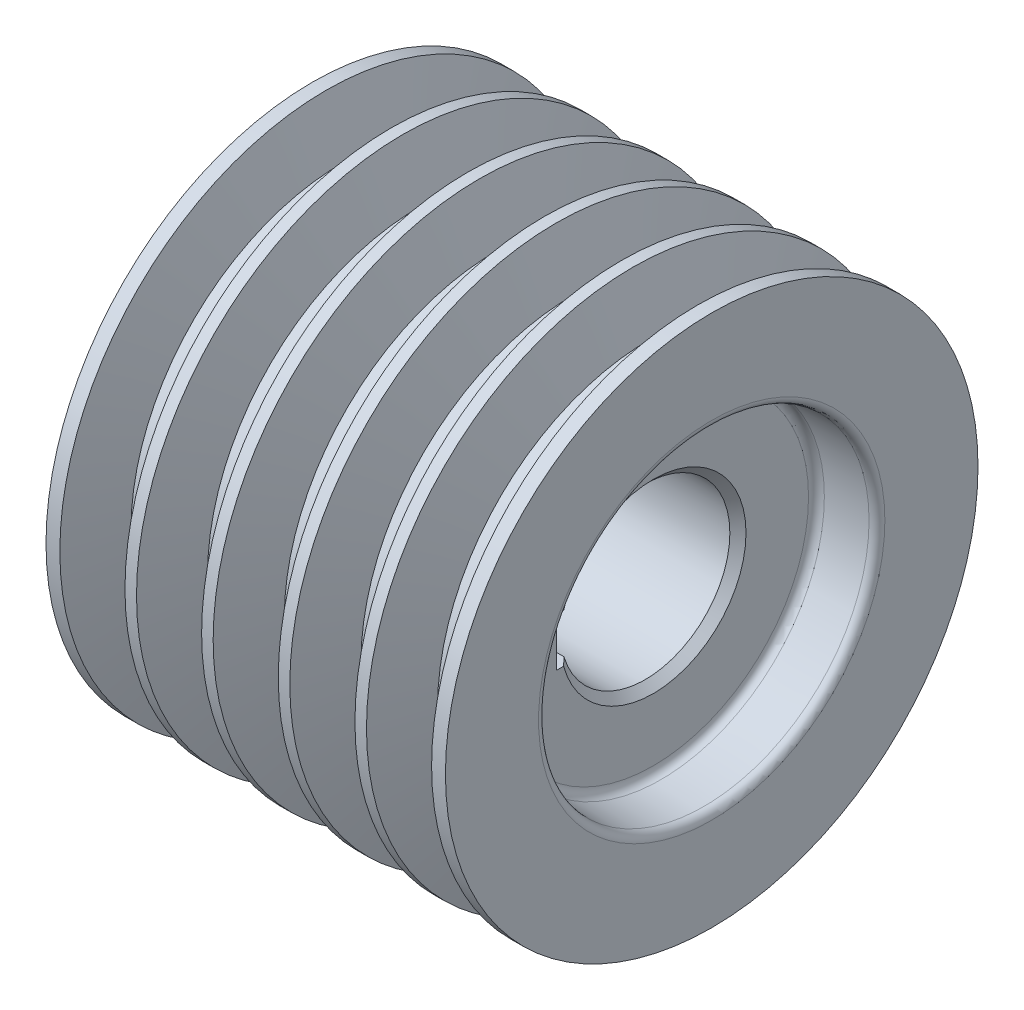
ISO-10303-21;
HEADER;
FILE_DESCRIPTION(('STEP AP214'),'2;1');
FILE_NAME('part.step','',(''),(''),'','','');
FILE_SCHEMA(('AUTOMOTIVE_DESIGN { 1 0 10303 214 1 1 1 1 }'));
ENDSEC;
DATA;
#1=APPLICATION_CONTEXT('core data for automotive mechanical design processes');
#2=APPLICATION_PROTOCOL_DEFINITION('international standard','automotive_design',2000,#1);
#3=PRODUCT_CONTEXT('',#1,'mechanical');
#4=PRODUCT('Part','Part','',(#3));
#5=PRODUCT_RELATED_PRODUCT_CATEGORY('part','',(#4));
#6=PRODUCT_DEFINITION_FORMATION('','',#4);
#7=PRODUCT_DEFINITION_CONTEXT('part definition',#1,'design');
#8=PRODUCT_DEFINITION('design','',#6,#7);
#9=PRODUCT_DEFINITION_SHAPE('','',#8);
#10=(LENGTH_UNIT() NAMED_UNIT(*) SI_UNIT(.MILLI.,.METRE.));
#11=(NAMED_UNIT(*) PLANE_ANGLE_UNIT() SI_UNIT($,.RADIAN.));
#12=(NAMED_UNIT(*) SI_UNIT($,.STERADIAN.) SOLID_ANGLE_UNIT());
#13=UNCERTAINTY_MEASURE_WITH_UNIT(LENGTH_MEASURE(1.E-05),#10,'distance_accuracy_value','');
#14=(GEOMETRIC_REPRESENTATION_CONTEXT(3) GLOBAL_UNCERTAINTY_ASSIGNED_CONTEXT((#13)) GLOBAL_UNIT_ASSIGNED_CONTEXT((#10,
#11,#12)) REPRESENTATION_CONTEXT('',''));
#15=CARTESIAN_POINT('',(0.,0.,0.));
#16=DIRECTION('',(0.,0.,1.));
#17=DIRECTION('',(1.,0.,0.));
#18=AXIS2_PLACEMENT_3D('',#15,#16,#17);
#19=CARTESIAN_POINT('',(65.4522263599045,-20.8911772421215,0.));
#20=DIRECTION('',(1.,0.,0.));
#21=DIRECTION('',(0.,0.,1.));
#22=AXIS2_PLACEMENT_3D('',#19,#20,#21);
#23=PLANE('',#22);
#24=CARTESIAN_POINT('',(65.4522263599045,-20.8911772421215,0.));
#25=DIRECTION('',(1.,0.,0.));
#26=DIRECTION('',(0.,0.,-1.));
#27=AXIS2_PLACEMENT_3D('',#24,#25,#26);
#28=CIRCLE('',#27,38.4985347953821);
#29=CARTESIAN_POINT('',(65.4522263599045,-20.8911772421215,-38.4985347953821));
#30=VERTEX_POINT('',#29);
#31=EDGE_CURVE('E253',#30,#30,#28,.T.);
#32=ORIENTED_EDGE('',*,*,#31,.T.);
#33=EDGE_LOOP('',(#32));
#34=FACE_BOUND('',#33,.T.);
#35=CARTESIAN_POINT('',(65.4522263599045,-20.8911772421215,0.));
#36=DIRECTION('',(1.,0.,0.));
#37=DIRECTION('',(0.,0.,-1.));
#38=AXIS2_PLACEMENT_3D('',#35,#36,#37);
#39=CIRCLE('',#38,23.0000000000001);
#40=CARTESIAN_POINT('',(65.4522263599045,-14.8911772421215,22.2036033111746));
#41=VERTEX_POINT('',#40);
#42=CARTESIAN_POINT('',(65.4522263599045,-26.8911772421215,22.2036033111746));
#43=VERTEX_POINT('',#42);
#44=EDGE_CURVE('E264',#41,#43,#39,.F.);
#45=ORIENTED_EDGE('',*,*,#44,.T.);
#46=DIRECTION('',(0.,0.,1.));
#47=VECTOR('',#46,1.);
#48=CARTESIAN_POINT('',(65.4522263599045,-26.8911772421215,-84.8381979060779));
#49=LINE('',#48,#47);
#50=CARTESIAN_POINT('',(65.4522263599045,-26.8911772421215,24.));
#51=VERTEX_POINT('',#50);
#52=EDGE_CURVE('E109',#43,#51,#49,.T.);
#53=ORIENTED_EDGE('',*,*,#52,.T.);
#54=DIRECTION('',(0.,-1.,0.));
#55=VECTOR('',#54,1.);
#56=CARTESIAN_POINT('',(65.4522263599045,-20.8911772421215,24.));
#57=LINE('',#56,#55);
#58=CARTESIAN_POINT('',(65.4522263599045,-14.8911772421215,24.));
#59=VERTEX_POINT('',#58);
#60=EDGE_CURVE('E105',#59,#51,#57,.T.);
#61=ORIENTED_EDGE('',*,*,#60,.F.);
#62=DIRECTION('',(0.,0.,1.));
#63=VECTOR('',#62,1.);
#64=CARTESIAN_POINT('',(65.4522263599045,-14.8911772421215,-84.8381979060779));
#65=LINE('',#64,#63);
#66=EDGE_CURVE('E112',#41,#59,#65,.T.);
#67=ORIENTED_EDGE('',*,*,#66,.F.);
#68=EDGE_LOOP('',(#45,#53,#61,#67));
#69=FACE_BOUND('',#68,.T.);
#70=ADVANCED_FACE('F47',(#34,#69),#23,.T.);
#71=CARTESIAN_POINT('',(-4.54777364009548,-20.8911772421215,0.));
#72=DIRECTION('',(-1.,0.,0.));
#73=DIRECTION('',(0.,0.,1.));
#74=AXIS2_PLACEMENT_3D('',#71,#72,#73);
#75=PLANE('',#74);
#76=CARTESIAN_POINT('',(-4.54777364009548,-20.8911772421215,0.));
#77=DIRECTION('',(-1.,0.,0.));
#78=DIRECTION('',(0.,0.,1.));
#79=AXIS2_PLACEMENT_3D('',#76,#77,#78);
#80=CIRCLE('',#79,38.4985347953821);
#81=CARTESIAN_POINT('',(-4.54777364009548,-20.8911772421215,38.4985347953821));
#82=VERTEX_POINT('',#81);
#83=EDGE_CURVE('E235',#82,#82,#80,.T.);
#84=ORIENTED_EDGE('',*,*,#83,.T.);
#85=EDGE_LOOP('',(#84));
#86=FACE_BOUND('',#85,.T.);
#87=DIRECTION('',(0.,1.,0.));
#88=VECTOR('',#87,1.);
#89=CARTESIAN_POINT('',(-4.54777364009548,-20.8911772421215,24.));
#90=LINE('',#89,#88);
#91=CARTESIAN_POINT('',(-4.54777364009548,-26.8911772421215,24.));
#92=VERTEX_POINT('',#91);
#93=CARTESIAN_POINT('',(-4.54777364009548,-14.8911772421215,24.));
#94=VERTEX_POINT('',#93);
#95=EDGE_CURVE('E13',#92,#94,#90,.T.);
#96=ORIENTED_EDGE('',*,*,#95,.F.);
#97=DIRECTION('',(0.,0.,-1.));
#98=VECTOR('',#97,1.);
#99=CARTESIAN_POINT('',(-4.54777364009548,-26.8911772421215,0.));
#100=LINE('',#99,#98);
#101=CARTESIAN_POINT('',(-4.54777364009548,-26.8911772421215,22.2036033111746));
#102=VERTEX_POINT('',#101);
#103=EDGE_CURVE('E169',#92,#102,#100,.T.);
#104=ORIENTED_EDGE('',*,*,#103,.T.);
#105=CARTESIAN_POINT('',(-4.54777364009548,-20.8911772421215,0.));
#106=DIRECTION('',(-1.,0.,0.));
#107=DIRECTION('',(0.,0.,1.));
#108=AXIS2_PLACEMENT_3D('',#105,#106,#107);
#109=CIRCLE('',#108,23.0000000000001);
#110=CARTESIAN_POINT('',(-4.54777364009548,-14.8911772421215,22.2036033111746));
#111=VERTEX_POINT('',#110);
#112=EDGE_CURVE('E152',#102,#111,#109,.F.);
#113=ORIENTED_EDGE('',*,*,#112,.T.);
#114=DIRECTION('',(0.,0.,-1.));
#115=VECTOR('',#114,1.);
#116=CARTESIAN_POINT('',(-4.54777364009548,-14.8911772421215,0.));
#117=LINE('',#116,#115);
#118=EDGE_CURVE('E63',#94,#111,#117,.T.);
#119=ORIENTED_EDGE('',*,*,#118,.F.);
#120=EDGE_LOOP('',(#96,#104,#113,#119));
#121=FACE_BOUND('',#120,.T.);
#122=ADVANCED_FACE('F269',(#86,#121),#75,.T.);
#123=CARTESIAN_POINT('',(79.9522263599045,-20.8911772421215,0.));
#124=DIRECTION('',(-1.,0.,0.));
#125=DIRECTION('',(0.,0.,1.));
#126=AXIS2_PLACEMENT_3D('',#123,#124,#125);
#127=CYLINDRICAL_SURFACE('',#126,21.);
#128=DIRECTION('',(-1.,0.,0.));
#129=VECTOR('',#128,1.);
#130=CARTESIAN_POINT('',(79.9522263599045,-26.8911772421215,20.1246117974981));
#131=LINE('',#130,#129);
#132=CARTESIAN_POINT('',(63.4522263599045,-26.8911772421215,20.1246117974981));
#133=VERTEX_POINT('',#132);
#134=CARTESIAN_POINT('',(-2.54777364009537,-26.8911772421215,20.1246117974981));
#135=VERTEX_POINT('',#134);
#136=EDGE_CURVE('E133',#133,#135,#131,.T.);
#137=ORIENTED_EDGE('',*,*,#136,.F.);
#138=CARTESIAN_POINT('',(63.4522263599045,-20.8911772421215,0.));
#139=DIRECTION('',(1.,0.,0.));
#140=DIRECTION('',(0.,0.,-1.));
#141=AXIS2_PLACEMENT_3D('',#138,#139,#140);
#142=CIRCLE('',#141,21.);
#143=CARTESIAN_POINT('',(63.4522263599045,-14.8911772421215,20.1246117974981));
#144=VERTEX_POINT('',#143);
#145=EDGE_CURVE('E262',#133,#144,#142,.T.);
#146=ORIENTED_EDGE('',*,*,#145,.T.);
#147=DIRECTION('',(-1.,0.,0.));
#148=VECTOR('',#147,1.);
#149=CARTESIAN_POINT('',(79.9522263599045,-14.8911772421215,20.1246117974981));
#150=LINE('',#149,#148);
#151=CARTESIAN_POINT('',(-2.54777364009537,-14.8911772421215,20.1246117974981));
#152=VERTEX_POINT('',#151);
#153=EDGE_CURVE('E123',#144,#152,#150,.T.);
#154=ORIENTED_EDGE('',*,*,#153,.T.);
#155=CARTESIAN_POINT('',(-2.54777364009537,-20.8911772421215,0.));
#156=DIRECTION('',(-1.,0.,0.));
#157=DIRECTION('',(0.,0.,1.));
#158=AXIS2_PLACEMENT_3D('',#155,#156,#157);
#159=CIRCLE('',#158,21.);
#160=EDGE_CURVE('E259',#152,#135,#159,.T.);
#161=ORIENTED_EDGE('',*,*,#160,.T.);
#162=EDGE_LOOP('',(#137,#146,#154,#161));
#163=FACE_BOUND('',#162,.T.);
#164=ADVANCED_FACE('F143',(#163),#127,.F.);
#165=CARTESIAN_POINT('',(63.4522263599045,-20.8911772421215,0.));
#166=DIRECTION('',(1.,0.,0.));
#167=DIRECTION('',(0.,0.,-1.));
#168=AXIS2_PLACEMENT_3D('',#165,#166,#167);
#169=CONICAL_SURFACE('',#168,21.,0.785398163397455);
#170=ORIENTED_EDGE('',*,*,#145,.F.);
#171=CARTESIAN_POINT('',(54.8035117336276,-26.8911772421215,10.7960293804316));
#172=CARTESIAN_POINT('',(54.9874683818524,-26.8911772421215,11.0064760608039));
#173=CARTESIAN_POINT('',(55.1721324443452,-26.8911772421215,11.2163019613483));
#174=CARTESIAN_POINT('',(55.5426955892584,-26.8911772421215,11.6348571742131));
#175=CARTESIAN_POINT('',(55.7285946601478,-26.8911772421215,11.8435864967395));
#176=CARTESIAN_POINT('',(56.287865444874,-26.8911772421215,12.4683368309857));
#177=CARTESIAN_POINT('',(56.6628249676077,-26.8911772421215,12.8829364421599));
#178=CARTESIAN_POINT('',(57.4159203479209,-26.8911772421215,13.7091553987322));
#179=CARTESIAN_POINT('',(57.7940558684335,-26.8911772421215,14.1207750519698));
#180=CARTESIAN_POINT('',(58.5528411247313,-26.8911772421215,14.9416973461213));
#181=CARTESIAN_POINT('',(58.9334908888128,-26.8911772421215,15.3509999608617));
#182=CARTESIAN_POINT('',(59.6967265109114,-26.8911772421215,16.1676802660682));
#183=CARTESIAN_POINT('',(60.0793120716715,-26.8911772421215,16.5750582345497));
#184=CARTESIAN_POINT('',(60.8460942921171,-26.8911772421215,17.3882911500777));
#185=CARTESIAN_POINT('',(61.2302909453887,-26.8911772421215,17.7941461031753));
#186=CARTESIAN_POINT('',(62.38487308172,-26.8911772421215,19.0098703462348));
#187=CARTESIAN_POINT('',(63.1572251727058,-26.8911772421215,19.8178717460958));
#188=CARTESIAN_POINT('',(64.6575628550957,-26.8911772421215,21.380394176371));
#189=CARTESIAN_POINT('',(65.3853302659242,-26.8911772421215,22.1351250485647));
#190=CARTESIAN_POINT('',(66.8432381463396,-26.8911772421215,23.6422921576677));
#191=CARTESIAN_POINT('',(67.573378618481,-26.8911772421215,24.3947283921053));
#192=CARTESIAN_POINT('',(69.0354517777227,-26.8911772421215,25.8978423410628));
#193=CARTESIAN_POINT('',(69.7673844471831,-26.8911772421215,26.6485200727498));
#194=CARTESIAN_POINT('',(71.2326499096059,-26.8911772421215,28.14850794147));
#195=CARTESIAN_POINT('',(71.9659827030211,-26.8911772421215,28.8978180780607));
#196=CARTESIAN_POINT('',(73.4339285489622,-26.8911772421215,30.395524743977));
#197=CARTESIAN_POINT('',(74.1685418595948,-26.8911772421215,31.1439210202663));
#198=CARTESIAN_POINT('',(75.6386640120986,-26.8911772421215,32.6398337037583));
#199=CARTESIAN_POINT('',(76.374172854188,-26.8911772421215,33.3873501107466));
#200=CARTESIAN_POINT('',(77.8459182926841,-26.8911772421215,34.8816599216298));
#201=CARTESIAN_POINT('',(78.5821548860503,-26.8911772421215,35.6284533285199));
#202=CARTESIAN_POINT('',(80.0552384404733,-26.8911772421215,37.1214369154791));
#203=CARTESIAN_POINT('',(80.7920854011044,-26.8911772421215,37.8676270959683));
#204=CARTESIAN_POINT('',(81.5291778375467,-26.8911772421215,38.6135745144894));
#205=B_SPLINE_CURVE_WITH_KNOTS('',3,(#171,#172,#173,#174,#175,#176,#177,#178,#179,#180,#181,
#182,#183,#184,#185,#186,#187,#188,#189,#190,#191,#192,#193,#194,#195,#196,#197,#198,#199,#200,
#201,#202,#203,#204),.UNSPECIFIED.,.F.,.F.,(4,2,2,2,2,2,2,2,2,2,2,2,2,2,2,2,4),(0.,
0.838536441067098,1.67706506382705,3.35405753845586,5.03087422882484,6.70770982299641,
8.38429530016524,10.0608741089577,13.4141438782229,16.5595120886771,19.7048836860309,
22.8502244480418,25.9955662274287,29.1416395923243,32.2877137234949,35.4337747650234,
38.579833613669),.UNSPECIFIED.);
#206=EDGE_CURVE('E71',#133,#43,#205,.T.);
#207=ORIENTED_EDGE('',*,*,#206,.T.);
#208=ORIENTED_EDGE('',*,*,#44,.F.);
#209=CARTESIAN_POINT('',(54.8035117336276,-14.8911772421215,10.7960293804316));
#210=CARTESIAN_POINT('',(54.9874683818524,-14.8911772421215,11.0064760608039));
#211=CARTESIAN_POINT('',(55.1721324443452,-14.8911772421215,11.2163019613484));
#212=CARTESIAN_POINT('',(55.5426955892584,-14.8911772421215,11.6348571742131));
#213=CARTESIAN_POINT('',(55.7285946601478,-14.8911772421215,11.8435864967395));
#214=CARTESIAN_POINT('',(56.287865444874,-14.8911772421215,12.4683368309857));
#215=CARTESIAN_POINT('',(56.6628249676077,-14.8911772421215,12.8829364421599));
#216=CARTESIAN_POINT('',(57.4159203479209,-14.8911772421215,13.7091553987323));
#217=CARTESIAN_POINT('',(57.7940558684335,-14.8911772421215,14.1207750519698));
#218=CARTESIAN_POINT('',(58.5528411247313,-14.8911772421215,14.9416973461213));
#219=CARTESIAN_POINT('',(58.9334908888128,-14.8911772421215,15.3509999608617));
#220=CARTESIAN_POINT('',(59.6967265109114,-14.8911772421215,16.1676802660682));
#221=CARTESIAN_POINT('',(60.0793120716715,-14.8911772421215,16.5750582345497));
#222=CARTESIAN_POINT('',(60.8460942921171,-14.8911772421215,17.3882911500777));
#223=CARTESIAN_POINT('',(61.2302909453887,-14.8911772421215,17.7941461031753));
#224=CARTESIAN_POINT('',(62.38487308172,-14.8911772421215,19.0098703462348));
#225=CARTESIAN_POINT('',(63.1572251727058,-14.8911772421215,19.8178717460958));
#226=CARTESIAN_POINT('',(64.6575628550957,-14.8911772421215,21.380394176371));
#227=CARTESIAN_POINT('',(65.3853302659242,-14.8911772421215,22.1351250485647));
#228=CARTESIAN_POINT('',(66.8432381463396,-14.8911772421215,23.6422921576677));
#229=CARTESIAN_POINT('',(67.573378618481,-14.8911772421215,24.3947283921053));
#230=CARTESIAN_POINT('',(69.0354517777227,-14.8911772421215,25.8978423410628));
#231=CARTESIAN_POINT('',(69.7673844471831,-14.8911772421215,26.6485200727498));
#232=CARTESIAN_POINT('',(71.2326499096059,-14.8911772421215,28.14850794147));
#233=CARTESIAN_POINT('',(71.9659827030211,-14.8911772421215,28.8978180780606));
#234=CARTESIAN_POINT('',(73.4339285489622,-14.8911772421215,30.395524743977));
#235=CARTESIAN_POINT('',(74.1685418595948,-14.8911772421215,31.1439210202663));
#236=CARTESIAN_POINT('',(75.6386640120986,-14.8911772421215,32.6398337037583));
#237=CARTESIAN_POINT('',(76.374172854188,-14.8911772421215,33.3873501107466));
#238=CARTESIAN_POINT('',(77.8459182926841,-14.8911772421215,34.8816599216298));
#239=CARTESIAN_POINT('',(78.5821548860502,-14.8911772421215,35.6284533285199));
#240=CARTESIAN_POINT('',(80.0552384404733,-14.8911772421215,37.121436915479));
#241=CARTESIAN_POINT('',(80.7920854011044,-14.8911772421215,37.8676270959682));
#242=CARTESIAN_POINT('',(81.5291778375466,-14.8911772421215,38.6135745144893));
#243=B_SPLINE_CURVE_WITH_KNOTS('',3,(#209,#210,#211,#212,#213,#214,#215,#216,#217,#218,#219,
#220,#221,#222,#223,#224,#225,#226,#227,#228,#229,#230,#231,#232,#233,#234,#235,#236,#237,#238,
#239,#240,#241,#242),.UNSPECIFIED.,.F.,.F.,(4,2,2,2,2,2,2,2,2,2,2,2,2,2,2,2,4),(0.,
0.838536441067098,1.67706506382705,3.35405753845586,5.03087422882485,6.70770982299641,
8.38429530016524,10.0608741089577,13.4141438782229,16.5595120886771,19.7048836860309,
22.8502244480418,25.9955662274286,29.1416395923242,32.2877137234948,35.4337747650233,
38.5798336136689),.UNSPECIFIED.);
#244=EDGE_CURVE('E115',#144,#41,#243,.T.);
#245=ORIENTED_EDGE('',*,*,#244,.F.);
#246=EDGE_LOOP('',(#170,#207,#208,#245));
#247=FACE_BOUND('',#246,.T.);
#248=ADVANCED_FACE('F135',(#247),#169,.F.);
#249=CARTESIAN_POINT('',(-2.54777364009537,-20.8911772421215,0.));
#250=DIRECTION('',(-1.,0.,0.));
#251=DIRECTION('',(0.,0.,1.));
#252=AXIS2_PLACEMENT_3D('',#249,#250,#251);
#253=CONICAL_SURFACE('',#252,21.,0.785398163397445);
#254=ORIENTED_EDGE('',*,*,#112,.F.);
#255=CARTESIAN_POINT('',(-20.6247251177378,-26.8911772421215,38.6135745144893));
#256=CARTESIAN_POINT('',(-19.8876326812956,-26.8911772421215,37.8676270959682));
#257=CARTESIAN_POINT('',(-19.1507857206645,-26.8911772421215,37.121436915479));
#258=CARTESIAN_POINT('',(-17.6777021662414,-26.8911772421215,35.6284533285198));
#259=CARTESIAN_POINT('',(-16.9414655728753,-26.8911772421215,34.8816599216298));
#260=CARTESIAN_POINT('',(-15.4697201343791,-26.8911772421215,33.3873501107466));
#261=CARTESIAN_POINT('',(-14.7342112922897,-26.8911772421215,32.6398337037583));
#262=CARTESIAN_POINT('',(-13.2640891397859,-26.8911772421215,31.1439210202663));
#263=CARTESIAN_POINT('',(-12.5294758291533,-26.8911772421215,30.395524743977));
#264=CARTESIAN_POINT('',(-11.0615299832121,-26.8911772421215,28.8978180780606));
#265=CARTESIAN_POINT('',(-10.3281971897969,-26.8911772421215,28.1485079414699));
#266=CARTESIAN_POINT('',(-8.86293172737411,-26.8911772421215,26.6485200727498));
#267=CARTESIAN_POINT('',(-8.13099905791374,-26.8911772421215,25.8978423410628));
#268=CARTESIAN_POINT('',(-6.668925898672,-26.8911772421215,24.3947283921053));
#269=CARTESIAN_POINT('',(-5.9387854265306,-26.8911772421215,23.6422921576677));
#270=CARTESIAN_POINT('',(-4.48087754611513,-26.8911772421215,22.1351250485647));
#271=CARTESIAN_POINT('',(-3.75311013528662,-26.8911772421215,21.380394176371));
#272=CARTESIAN_POINT('',(-2.25277245289668,-26.8911772421215,19.8178717460958));
#273=CARTESIAN_POINT('',(-1.48042036191087,-26.8911772421215,19.0098703462348));
#274=CARTESIAN_POINT('',(-0.325838225579596,-26.8911772421215,17.7941461031753));
#275=CARTESIAN_POINT('',(0.0583584276920318,-26.8911772421215,17.3882911500776));
#276=CARTESIAN_POINT('',(0.825140648137732,-26.8911772421215,16.5750582345497));
#277=CARTESIAN_POINT('',(1.20772620889784,-26.8911772421215,16.1676802660682));
#278=CARTESIAN_POINT('',(1.97096183099643,-26.8911772421215,15.3509999608617));
#279=CARTESIAN_POINT('',(2.35161159507793,-26.8911772421215,14.9416973461213));
#280=CARTESIAN_POINT('',(3.11039685137578,-26.8911772421215,14.1207750519698));
#281=CARTESIAN_POINT('',(3.4885323718884,-26.8911772421215,13.7091553987322));
#282=CARTESIAN_POINT('',(4.2416277522016,-26.8911772421215,12.8829364421599));
#283=CARTESIAN_POINT('',(4.61658727493529,-26.8911772421215,12.4683368309857));
#284=CARTESIAN_POINT('',(5.17585805966156,-26.8911772421215,11.8435864967394));
#285=CARTESIAN_POINT('',(5.36175713055094,-26.8911772421215,11.6348571742131));
#286=CARTESIAN_POINT('',(5.73232027546416,-26.8911772421215,11.2163019613483));
#287=CARTESIAN_POINT('',(5.91698433795693,-26.8911772421215,11.0064760608038));
#288=CARTESIAN_POINT('',(6.10094098618177,-26.8911772421215,10.7960293804316));
#289=B_SPLINE_CURVE_WITH_KNOTS('',3,(#255,#256,#257,#258,#259,#260,#261,#262,#263,#264,#265,
#266,#267,#268,#269,#270,#271,#272,#273,#274,#275,#276,#277,#278,#279,#280,#281,#282,#283,#284,
#285,#286,#287,#288),.UNSPECIFIED.,.F.,.F.,(4,2,2,2,2,2,2,2,2,2,2,2,2,2,2,2,4),(0.,
3.1460588486456,6.29211989017414,9.43819402134471,12.5842673862404,15.7296091656272,
18.8749499276381,22.0203215249919,25.1656897354462,28.5189595047114,30.1955383135039,
31.8721237906728,33.5489593848444,35.2257760752134,36.9027685498422,37.7412971726022,
38.5798336136693),.UNSPECIFIED.);
#290=EDGE_CURVE('E56',#102,#135,#289,.T.);
#291=ORIENTED_EDGE('',*,*,#290,.T.);
#292=ORIENTED_EDGE('',*,*,#160,.F.);
#293=CARTESIAN_POINT('',(-20.6247251177378,-14.8911772421215,38.6135745144893));
#294=CARTESIAN_POINT('',(-19.8876326812956,-14.8911772421215,37.8676270959682));
#295=CARTESIAN_POINT('',(-19.1507857206645,-14.8911772421215,37.121436915479));
#296=CARTESIAN_POINT('',(-17.6777021662414,-14.8911772421215,35.6284533285198));
#297=CARTESIAN_POINT('',(-16.9414655728753,-14.8911772421215,34.8816599216298));
#298=CARTESIAN_POINT('',(-15.4697201343791,-14.8911772421215,33.3873501107466));
#299=CARTESIAN_POINT('',(-14.7342112922897,-14.8911772421215,32.6398337037583));
#300=CARTESIAN_POINT('',(-13.2640891397859,-14.8911772421215,31.1439210202663));
#301=CARTESIAN_POINT('',(-12.5294758291533,-14.8911772421215,30.395524743977));
#302=CARTESIAN_POINT('',(-11.0615299832121,-14.8911772421215,28.8978180780606));
#303=CARTESIAN_POINT('',(-10.3281971897969,-14.8911772421215,28.1485079414699));
#304=CARTESIAN_POINT('',(-8.86293172737411,-14.8911772421215,26.6485200727498));
#305=CARTESIAN_POINT('',(-8.13099905791374,-14.8911772421215,25.8978423410628));
#306=CARTESIAN_POINT('',(-6.668925898672,-14.8911772421215,24.3947283921053));
#307=CARTESIAN_POINT('',(-5.9387854265306,-14.8911772421215,23.6422921576677));
#308=CARTESIAN_POINT('',(-4.48087754611513,-14.8911772421215,22.1351250485647));
#309=CARTESIAN_POINT('',(-3.75311013528662,-14.8911772421215,21.380394176371));
#310=CARTESIAN_POINT('',(-2.25277245289668,-14.8911772421215,19.8178717460958));
#311=CARTESIAN_POINT('',(-1.48042036191087,-14.8911772421215,19.0098703462348));
#312=CARTESIAN_POINT('',(-0.325838225579596,-14.8911772421215,17.7941461031753));
#313=CARTESIAN_POINT('',(0.0583584276920305,-14.8911772421215,17.3882911500777));
#314=CARTESIAN_POINT('',(0.82514064813773,-14.8911772421215,16.5750582345497));
#315=CARTESIAN_POINT('',(1.20772620889784,-14.8911772421215,16.1676802660682));
#316=CARTESIAN_POINT('',(1.97096183099643,-14.8911772421215,15.3509999608617));
#317=CARTESIAN_POINT('',(2.35161159507793,-14.8911772421215,14.9416973461213));
#318=CARTESIAN_POINT('',(3.11039685137578,-14.8911772421215,14.1207750519698));
#319=CARTESIAN_POINT('',(3.4885323718884,-14.8911772421215,13.7091553987322));
#320=CARTESIAN_POINT('',(4.2416277522016,-14.8911772421215,12.8829364421599));
#321=CARTESIAN_POINT('',(4.61658727493529,-14.8911772421215,12.4683368309857));
#322=CARTESIAN_POINT('',(5.17585805966156,-14.8911772421215,11.8435864967394));
#323=CARTESIAN_POINT('',(5.36175713055094,-14.8911772421215,11.6348571742131));
#324=CARTESIAN_POINT('',(5.73232027546416,-14.8911772421215,11.2163019613483));
#325=CARTESIAN_POINT('',(5.91698433795693,-14.8911772421215,11.0064760608038));
#326=CARTESIAN_POINT('',(6.10094098618178,-14.8911772421215,10.7960293804316));
#327=B_SPLINE_CURVE_WITH_KNOTS('',3,(#293,#294,#295,#296,#297,#298,#299,#300,#301,#302,#303,
#304,#305,#306,#307,#308,#309,#310,#311,#312,#313,#314,#315,#316,#317,#318,#319,#320,#321,#322,
#323,#324,#325,#326),.UNSPECIFIED.,.F.,.F.,(4,2,2,2,2,2,2,2,2,2,2,2,2,2,2,2,4),(0.,
3.1460588486456,6.29211989017414,9.43819402134471,12.5842673862404,15.7296091656272,
18.8749499276381,22.0203215249919,25.1656897354462,28.5189595047114,30.1955383135039,
31.8721237906728,33.5489593848444,35.2257760752134,36.9027685498423,37.7412971726022,
38.5798336136693),.UNSPECIFIED.);
#328=EDGE_CURVE('E147',#111,#152,#327,.T.);
#329=ORIENTED_EDGE('',*,*,#328,.F.);
#330=EDGE_LOOP('',(#254,#291,#292,#329));
#331=FACE_BOUND('',#330,.T.);
#332=ADVANCED_FACE('F49',(#331),#253,.F.);
#333=CARTESIAN_POINT('',(-19.0477736400955,-20.8911772421215,0.));
#334=DIRECTION('',(-1.,0.,0.));
#335=DIRECTION('',(0.,0.,1.));
#336=AXIS2_PLACEMENT_3D('',#333,#334,#335);
#337=CYLINDRICAL_SURFACE('',#336,66.);
#338=CARTESIAN_POINT('',(3.38216897479922,-20.8911772421215,0.));
#339=DIRECTION('',(-1.,0.,0.));
#340=DIRECTION('',(0.,0.,1.));
#341=AXIS2_PLACEMENT_3D('',#338,#339,#340);
#342=CIRCLE('',#341,66.);
#343=CARTESIAN_POINT('',(3.38216897479922,-20.8911772421215,66.));
#344=VERTEX_POINT('',#343);
#345=EDGE_CURVE('E181',#344,#344,#342,.T.);
#346=ORIENTED_EDGE('',*,*,#345,.T.);
#347=EDGE_LOOP('',(#346));
#348=FACE_BOUND('',#347,.T.);
#349=CARTESIAN_POINT('',(0.522283745009733,-20.8911772421215,0.));
#350=DIRECTION('',(-1.,0.,0.));
#351=DIRECTION('',(0.,0.,1.));
#352=AXIS2_PLACEMENT_3D('',#349,#350,#351);
#353=CIRCLE('',#352,66.);
#354=CARTESIAN_POINT('',(0.522283745009733,-20.8911772421215,66.));
#355=VERTEX_POINT('',#354);
#356=EDGE_CURVE('E178',#355,#355,#353,.T.);
#357=ORIENTED_EDGE('',*,*,#356,.F.);
#358=EDGE_LOOP('',(#357));
#359=FACE_BOUND('',#358,.T.);
#360=ADVANCED_FACE('F280',(#348,#359),#337,.T.);
#361=CARTESIAN_POINT('',(22.3821689747992,-20.8911772421215,0.));
#362=DIRECTION('',(-1.,0.,0.));
#363=DIRECTION('',(0.,0.,1.));
#364=AXIS2_PLACEMENT_3D('',#361,#362,#363);
#365=CIRCLE('',#364,66.);
#366=CARTESIAN_POINT('',(22.3821689747992,-20.8911772421215,66.));
#367=VERTEX_POINT('',#366);
#368=EDGE_CURVE('E193',#367,#367,#365,.T.);
#369=ORIENTED_EDGE('',*,*,#368,.T.);
#370=EDGE_LOOP('',(#369));
#371=FACE_BOUND('',#370,.T.);
#372=CARTESIAN_POINT('',(19.5222837450097,-20.8911772421215,0.));
#373=DIRECTION('',(-1.,0.,0.));
#374=DIRECTION('',(0.,0.,1.));
#375=AXIS2_PLACEMENT_3D('',#372,#373,#374);
#376=CIRCLE('',#375,66.);
#377=CARTESIAN_POINT('',(19.5222837450097,-20.8911772421215,66.));
#378=VERTEX_POINT('',#377);
#379=EDGE_CURVE('E190',#378,#378,#376,.T.);
#380=ORIENTED_EDGE('',*,*,#379,.F.);
#381=EDGE_LOOP('',(#380));
#382=FACE_BOUND('',#381,.T.);
#383=ADVANCED_FACE('F380',(#371,#382),#337,.T.);
#384=CARTESIAN_POINT('',(41.3821689747992,-20.8911772421215,0.));
#385=DIRECTION('',(-1.,0.,0.));
#386=DIRECTION('',(0.,0.,1.));
#387=AXIS2_PLACEMENT_3D('',#384,#385,#386);
#388=CIRCLE('',#387,66.);
#389=CARTESIAN_POINT('',(41.3821689747992,-20.8911772421215,66.));
#390=VERTEX_POINT('',#389);
#391=EDGE_CURVE('E205',#390,#390,#388,.T.);
#392=ORIENTED_EDGE('',*,*,#391,.T.);
#393=EDGE_LOOP('',(#392));
#394=FACE_BOUND('',#393,.T.);
#395=CARTESIAN_POINT('',(38.5222837450097,-20.8911772421215,0.));
#396=DIRECTION('',(-1.,0.,0.));
#397=DIRECTION('',(0.,0.,1.));
#398=AXIS2_PLACEMENT_3D('',#395,#396,#397);
#399=CIRCLE('',#398,66.);
#400=CARTESIAN_POINT('',(38.5222837450097,-20.8911772421215,66.));
#401=VERTEX_POINT('',#400);
#402=EDGE_CURVE('E202',#401,#401,#399,.T.);
#403=ORIENTED_EDGE('',*,*,#402,.F.);
#404=EDGE_LOOP('',(#403));
#405=FACE_BOUND('',#404,.T.);
#406=ADVANCED_FACE('F357',(#394,#405),#337,.T.);
#407=CARTESIAN_POINT('',(60.3821689747992,-20.8911772421215,0.));
#408=DIRECTION('',(-1.,0.,0.));
#409=DIRECTION('',(0.,0.,1.));
#410=AXIS2_PLACEMENT_3D('',#407,#408,#409);
#411=CIRCLE('',#410,66.);
#412=CARTESIAN_POINT('',(60.3821689747992,-20.8911772421215,66.));
#413=VERTEX_POINT('',#412);
#414=EDGE_CURVE('E217',#413,#413,#411,.T.);
#415=ORIENTED_EDGE('',*,*,#414,.T.);
#416=EDGE_LOOP('',(#415));
#417=FACE_BOUND('',#416,.T.);
#418=CARTESIAN_POINT('',(57.5222837450097,-20.8911772421215,0.));
#419=DIRECTION('',(-1.,0.,0.));
#420=DIRECTION('',(0.,0.,1.));
#421=AXIS2_PLACEMENT_3D('',#418,#419,#420);
#422=CIRCLE('',#421,66.);
#423=CARTESIAN_POINT('',(57.5222837450097,-20.8911772421215,66.));
#424=VERTEX_POINT('',#423);
#425=EDGE_CURVE('E214',#424,#424,#422,.T.);
#426=ORIENTED_EDGE('',*,*,#425,.F.);
#427=EDGE_LOOP('',(#426));
#428=FACE_BOUND('',#427,.T.);
#429=ADVANCED_FACE('F312',(#417,#428),#337,.T.);
#430=CARTESIAN_POINT('',(79.9522263599045,-20.8911772421215,0.));
#431=DIRECTION('',(-1.,0.,0.));
#432=DIRECTION('',(0.,0.,1.));
#433=AXIS2_PLACEMENT_3D('',#430,#431,#432);
#434=CIRCLE('',#433,66.);
#435=CARTESIAN_POINT('',(79.9522263599045,-20.8911772421215,66.));
#436=VERTEX_POINT('',#435);
#437=EDGE_CURVE('E232',#436,#436,#434,.T.);
#438=ORIENTED_EDGE('',*,*,#437,.T.);
#439=EDGE_LOOP('',(#438));
#440=FACE_BOUND('',#439,.T.);
#441=CARTESIAN_POINT('',(76.5222837450097,-20.8911772421215,0.));
#442=DIRECTION('',(-1.,0.,0.));
#443=DIRECTION('',(0.,0.,1.));
#444=AXIS2_PLACEMENT_3D('',#441,#442,#443);
#445=CIRCLE('',#444,66.);
#446=CARTESIAN_POINT('',(76.5222837450097,-20.8911772421215,66.));
#447=VERTEX_POINT('',#446);
#448=EDGE_CURVE('E226',#447,#447,#445,.T.);
#449=ORIENTED_EDGE('',*,*,#448,.F.);
#450=EDGE_LOOP('',(#449));
#451=FACE_BOUND('',#450,.T.);
#452=ADVANCED_FACE('F309',(#440,#451),#337,.T.);
#453=CARTESIAN_POINT('',(79.9522263599045,-80.5798027700678,0.));
#454=DIRECTION('',(1.,0.,0.));
#455=DIRECTION('',(0.,0.,-1.));
#456=AXIS2_PLACEMENT_3D('',#453,#454,#455);
#457=PLANE('',#456);
#458=CARTESIAN_POINT('',(79.9522263599045,-20.8911772421215,0.));
#459=DIRECTION('',(1.,0.,0.));
#460=DIRECTION('',(0.,0.,-1.));
#461=AXIS2_PLACEMENT_3D('',#458,#459,#460);
#462=CIRCLE('',#461,42.9216198367313);
#463=CARTESIAN_POINT('',(79.9522263599045,-20.8911772421215,-42.9216198367313));
#464=VERTEX_POINT('',#463);
#465=EDGE_CURVE('E256',#464,#464,#462,.F.);
#466=ORIENTED_EDGE('',*,*,#465,.T.);
#467=EDGE_LOOP('',(#466));
#468=FACE_BOUND('',#467,.T.);
#469=ORIENTED_EDGE('',*,*,#437,.F.);
#470=EDGE_LOOP('',(#469));
#471=FACE_BOUND('',#470,.T.);
#472=ADVANCED_FACE('F296',(#468,#471),#457,.T.);
#473=CARTESIAN_POINT('',(79.9522263599045,-20.8911772421215,0.));
#474=DIRECTION('',(1.,0.,0.));
#475=DIRECTION('',(0.,0.,1.));
#476=AXIS2_PLACEMENT_3D('',#473,#474,#475);
#477=CONICAL_SURFACE('',#476,41.,0.0399680398706702);
#478=CARTESIAN_POINT('',(67.3723115607014,-20.8911772421215,0.));
#479=DIRECTION('',(1.,0.,0.));
#480=DIRECTION('',(0.,0.,-1.));
#481=AXIS2_PLACEMENT_3D('',#478,#479,#480);
#482=CIRCLE('',#481,40.496937563812);
#483=CARTESIAN_POINT('',(67.3723115607014,-20.8911772421215,-40.496937563812));
#484=VERTEX_POINT('',#483);
#485=EDGE_CURVE('E250',#484,#484,#482,.F.);
#486=ORIENTED_EDGE('',*,*,#485,.T.);
#487=EDGE_LOOP('',(#486));
#488=FACE_BOUND('',#487,.T.);
#489=CARTESIAN_POINT('',(78.0321411591077,-20.8911772421215,0.));
#490=DIRECTION('',(-1.,0.,0.));
#491=DIRECTION('',(0.,0.,1.));
#492=AXIS2_PLACEMENT_3D('',#489,#490,#491);
#493=CIRCLE('',#492,40.9232170683014);
#494=CARTESIAN_POINT('',(78.0321411591077,-20.8911772421215,40.9232170683014));
#495=VERTEX_POINT('',#494);
#496=EDGE_CURVE('E247',#495,#495,#493,.F.);
#497=ORIENTED_EDGE('',*,*,#496,.T.);
#498=EDGE_LOOP('',(#497));
#499=FACE_BOUND('',#498,.T.);
#500=ADVANCED_FACE('F293',(#488,#499),#477,.F.);
#501=CARTESIAN_POINT('',(67.4522263599045,-20.8911772421215,0.));
#502=DIRECTION('',(1.,0.,0.));
#503=DIRECTION('',(0.,0.,-1.));
#504=AXIS2_PLACEMENT_3D('',#501,#502,#503);
#505=TOROIDAL_SURFACE('',#504,38.4985347953821,2.);
#506=ORIENTED_EDGE('',*,*,#31,.F.);
#507=EDGE_LOOP('',(#506));
#508=FACE_BOUND('',#507,.T.);
#509=ORIENTED_EDGE('',*,*,#485,.F.);
#510=EDGE_LOOP('',(#509));
#511=FACE_BOUND('',#510,.T.);
#512=ADVANCED_FACE('F295',(#508,#511),#505,.F.);
#513=CARTESIAN_POINT('',(77.9522263599045,-20.8911772421215,0.));
#514=DIRECTION('',(1.,0.,0.));
#515=DIRECTION('',(0.,0.,-1.));
#516=AXIS2_PLACEMENT_3D('',#513,#514,#515);
#517=TOROIDAL_SURFACE('',#516,42.9216198367313,2.);
#518=ORIENTED_EDGE('',*,*,#496,.F.);
#519=EDGE_LOOP('',(#518));
#520=FACE_BOUND('',#519,.T.);
#521=ORIENTED_EDGE('',*,*,#465,.F.);
#522=EDGE_LOOP('',(#521));
#523=FACE_BOUND('',#522,.T.);
#524=ADVANCED_FACE('F325',(#520,#523),#517,.T.);
#525=CARTESIAN_POINT('',(72.3949195453179,-20.8911772421215,0.));
#526=DIRECTION('',(1.,0.,0.));
#527=DIRECTION('',(0.,0.,-1.));
#528=AXIS2_PLACEMENT_3D('',#525,#526,#527);
#529=CONICAL_SURFACE('',#528,52.5,1.27409035395587);
#530=ORIENTED_EDGE('',*,*,#448,.T.);
#531=EDGE_LOOP('',(#530));
#532=FACE_BOUND('',#531,.T.);
#533=CARTESIAN_POINT('',(72.3949195453179,-20.8911772421215,0.));
#534=DIRECTION('',(-1.,0.,0.));
#535=DIRECTION('',(0.,0.,1.));
#536=AXIS2_PLACEMENT_3D('',#533,#534,#535);
#537=CIRCLE('',#536,52.5);
#538=CARTESIAN_POINT('',(72.3949195453179,-20.8911772421215,52.5));
#539=VERTEX_POINT('',#538);
#540=EDGE_CURVE('E223',#539,#539,#537,.T.);
#541=ORIENTED_EDGE('',*,*,#540,.F.);
#542=EDGE_LOOP('',(#541));
#543=FACE_BOUND('',#542,.T.);
#544=ADVANCED_FACE('F291',(#532,#543),#529,.T.);
#545=CARTESIAN_POINT('',(72.3949195453179,-20.8911772421215,0.));
#546=DIRECTION('',(-1.,0.,0.));
#547=DIRECTION('',(0.,0.,1.));
#548=AXIS2_PLACEMENT_3D('',#545,#546,#547);
#549=CYLINDRICAL_SURFACE('',#548,52.5);
#550=ORIENTED_EDGE('',*,*,#540,.T.);
#551=EDGE_LOOP('',(#550));
#552=FACE_BOUND('',#551,.T.);
#553=CARTESIAN_POINT('',(64.5095331744912,-20.8911772421215,0.));
#554=DIRECTION('',(-1.,0.,0.));
#555=DIRECTION('',(0.,0.,1.));
#556=AXIS2_PLACEMENT_3D('',#553,#554,#555);
#557=CIRCLE('',#556,52.5);
#558=CARTESIAN_POINT('',(64.5095331744912,-20.8911772421215,52.5));
#559=VERTEX_POINT('',#558);
#560=EDGE_CURVE('E220',#559,#559,#557,.T.);
#561=ORIENTED_EDGE('',*,*,#560,.F.);
#562=EDGE_LOOP('',(#561));
#563=FACE_BOUND('',#562,.T.);
#564=ADVANCED_FACE('F332',(#552,#563),#549,.T.);
#565=CARTESIAN_POINT('',(60.3821689747992,-20.8911772421215,0.));
#566=DIRECTION('',(-1.,0.,0.));
#567=DIRECTION('',(0.,0.,1.));
#568=AXIS2_PLACEMENT_3D('',#565,#566,#567);
#569=CONICAL_SURFACE('',#568,66.,1.27409035395586);
#570=ORIENTED_EDGE('',*,*,#560,.T.);
#571=EDGE_LOOP('',(#570));
#572=FACE_BOUND('',#571,.T.);
#573=ORIENTED_EDGE('',*,*,#414,.F.);
#574=EDGE_LOOP('',(#573));
#575=FACE_BOUND('',#574,.T.);
#576=ADVANCED_FACE('F346',(#572,#575),#569,.T.);
#577=CARTESIAN_POINT('',(53.3949195453179,-20.8911772421215,0.));
#578=DIRECTION('',(1.,0.,0.));
#579=DIRECTION('',(0.,0.,-1.));
#580=AXIS2_PLACEMENT_3D('',#577,#578,#579);
#581=CONICAL_SURFACE('',#580,52.5,1.27409035395587);
#582=ORIENTED_EDGE('',*,*,#425,.T.);
#583=EDGE_LOOP('',(#582));
#584=FACE_BOUND('',#583,.T.);
#585=CARTESIAN_POINT('',(53.3949195453179,-20.8911772421215,0.));
#586=DIRECTION('',(-1.,0.,0.));
#587=DIRECTION('',(0.,0.,1.));
#588=AXIS2_PLACEMENT_3D('',#585,#586,#587);
#589=CIRCLE('',#588,52.5);
#590=CARTESIAN_POINT('',(53.3949195453179,-20.8911772421215,52.5));
#591=VERTEX_POINT('',#590);
#592=EDGE_CURVE('E211',#591,#591,#589,.T.);
#593=ORIENTED_EDGE('',*,*,#592,.F.);
#594=EDGE_LOOP('',(#593));
#595=FACE_BOUND('',#594,.T.);
#596=ADVANCED_FACE('F351',(#584,#595),#581,.T.);
#597=CARTESIAN_POINT('',(53.3949195453179,-20.8911772421215,0.));
#598=DIRECTION('',(-1.,0.,0.));
#599=DIRECTION('',(0.,0.,1.));
#600=AXIS2_PLACEMENT_3D('',#597,#598,#599);
#601=CYLINDRICAL_SURFACE('',#600,52.5);
#602=ORIENTED_EDGE('',*,*,#592,.T.);
#603=EDGE_LOOP('',(#602));
#604=FACE_BOUND('',#603,.T.);
#605=CARTESIAN_POINT('',(45.5095331744912,-20.8911772421215,0.));
#606=DIRECTION('',(-1.,0.,0.));
#607=DIRECTION('',(0.,0.,1.));
#608=AXIS2_PLACEMENT_3D('',#605,#606,#607);
#609=CIRCLE('',#608,52.5);
#610=CARTESIAN_POINT('',(45.5095331744912,-20.8911772421215,52.5));
#611=VERTEX_POINT('',#610);
#612=EDGE_CURVE('E208',#611,#611,#609,.T.);
#613=ORIENTED_EDGE('',*,*,#612,.F.);
#614=EDGE_LOOP('',(#613));
#615=FACE_BOUND('',#614,.T.);
#616=ADVANCED_FACE('F362',(#604,#615),#601,.T.);
#617=CARTESIAN_POINT('',(41.3821689747992,-20.8911772421215,0.));
#618=DIRECTION('',(-1.,0.,0.));
#619=DIRECTION('',(0.,0.,1.));
#620=AXIS2_PLACEMENT_3D('',#617,#618,#619);
#621=CONICAL_SURFACE('',#620,66.,1.27409035395586);
#622=ORIENTED_EDGE('',*,*,#612,.T.);
#623=EDGE_LOOP('',(#622));
#624=FACE_BOUND('',#623,.T.);
#625=ORIENTED_EDGE('',*,*,#391,.F.);
#626=EDGE_LOOP('',(#625));
#627=FACE_BOUND('',#626,.T.);
#628=ADVANCED_FACE('F368',(#624,#627),#621,.T.);
#629=CARTESIAN_POINT('',(34.3949195453179,-20.8911772421215,0.));
#630=DIRECTION('',(1.,0.,0.));
#631=DIRECTION('',(0.,0.,-1.));
#632=AXIS2_PLACEMENT_3D('',#629,#630,#631);
#633=CONICAL_SURFACE('',#632,52.5,1.27409035395587);
#634=ORIENTED_EDGE('',*,*,#402,.T.);
#635=EDGE_LOOP('',(#634));
#636=FACE_BOUND('',#635,.T.);
#637=CARTESIAN_POINT('',(34.3949195453179,-20.8911772421215,0.));
#638=DIRECTION('',(-1.,0.,0.));
#639=DIRECTION('',(0.,0.,1.));
#640=AXIS2_PLACEMENT_3D('',#637,#638,#639);
#641=CIRCLE('',#640,52.5);
#642=CARTESIAN_POINT('',(34.3949195453179,-20.8911772421215,52.5));
#643=VERTEX_POINT('',#642);
#644=EDGE_CURVE('E199',#643,#643,#641,.T.);
#645=ORIENTED_EDGE('',*,*,#644,.F.);
#646=EDGE_LOOP('',(#645));
#647=FACE_BOUND('',#646,.T.);
#648=ADVANCED_FACE('F374',(#636,#647),#633,.T.);
#649=CARTESIAN_POINT('',(34.3949195453179,-20.8911772421215,0.));
#650=DIRECTION('',(-1.,0.,0.));
#651=DIRECTION('',(0.,0.,1.));
#652=AXIS2_PLACEMENT_3D('',#649,#650,#651);
#653=CYLINDRICAL_SURFACE('',#652,52.5);
#654=ORIENTED_EDGE('',*,*,#644,.T.);
#655=EDGE_LOOP('',(#654));
#656=FACE_BOUND('',#655,.T.);
#657=CARTESIAN_POINT('',(26.5095331744912,-20.8911772421215,0.));
#658=DIRECTION('',(-1.,0.,0.));
#659=DIRECTION('',(0.,0.,1.));
#660=AXIS2_PLACEMENT_3D('',#657,#658,#659);
#661=CIRCLE('',#660,52.5);
#662=CARTESIAN_POINT('',(26.5095331744912,-20.8911772421215,52.5));
#663=VERTEX_POINT('',#662);
#664=EDGE_CURVE('E196',#663,#663,#661,.T.);
#665=ORIENTED_EDGE('',*,*,#664,.F.);
#666=EDGE_LOOP('',(#665));
#667=FACE_BOUND('',#666,.T.);
#668=ADVANCED_FACE('F385',(#656,#667),#653,.T.);
#669=CARTESIAN_POINT('',(22.3821689747992,-20.8911772421215,0.));
#670=DIRECTION('',(-1.,0.,0.));
#671=DIRECTION('',(0.,0.,1.));
#672=AXIS2_PLACEMENT_3D('',#669,#670,#671);
#673=CONICAL_SURFACE('',#672,66.,1.27409035395586);
#674=ORIENTED_EDGE('',*,*,#664,.T.);
#675=EDGE_LOOP('',(#674));
#676=FACE_BOUND('',#675,.T.);
#677=ORIENTED_EDGE('',*,*,#368,.F.);
#678=EDGE_LOOP('',(#677));
#679=FACE_BOUND('',#678,.T.);
#680=ADVANCED_FACE('F391',(#676,#679),#673,.T.);
#681=CARTESIAN_POINT('',(15.3949195453179,-20.8911772421215,0.));
#682=DIRECTION('',(1.,0.,0.));
#683=DIRECTION('',(0.,0.,-1.));
#684=AXIS2_PLACEMENT_3D('',#681,#682,#683);
#685=CONICAL_SURFACE('',#684,52.5,1.27409035395587);
#686=ORIENTED_EDGE('',*,*,#379,.T.);
#687=EDGE_LOOP('',(#686));
#688=FACE_BOUND('',#687,.T.);
#689=CARTESIAN_POINT('',(15.3949195453179,-20.8911772421215,0.));
#690=DIRECTION('',(-1.,0.,0.));
#691=DIRECTION('',(0.,0.,1.));
#692=AXIS2_PLACEMENT_3D('',#689,#690,#691);
#693=CIRCLE('',#692,52.5);
#694=CARTESIAN_POINT('',(15.3949195453179,-20.8911772421215,52.5));
#695=VERTEX_POINT('',#694);
#696=EDGE_CURVE('E187',#695,#695,#693,.T.);
#697=ORIENTED_EDGE('',*,*,#696,.F.);
#698=EDGE_LOOP('',(#697));
#699=FACE_BOUND('',#698,.T.);
#700=ADVANCED_FACE('F397',(#688,#699),#685,.T.);
#701=CARTESIAN_POINT('',(15.3949195453179,-20.8911772421215,0.));
#702=DIRECTION('',(-1.,0.,0.));
#703=DIRECTION('',(0.,0.,1.));
#704=AXIS2_PLACEMENT_3D('',#701,#702,#703);
#705=CYLINDRICAL_SURFACE('',#704,52.5);
#706=ORIENTED_EDGE('',*,*,#696,.T.);
#707=EDGE_LOOP('',(#706));
#708=FACE_BOUND('',#707,.T.);
#709=CARTESIAN_POINT('',(7.50953317449116,-20.8911772421215,0.));
#710=DIRECTION('',(-1.,0.,0.));
#711=DIRECTION('',(0.,0.,1.));
#712=AXIS2_PLACEMENT_3D('',#709,#710,#711);
#713=CIRCLE('',#712,52.5);
#714=CARTESIAN_POINT('',(7.50953317449116,-20.8911772421215,52.5));
#715=VERTEX_POINT('',#714);
#716=EDGE_CURVE('E184',#715,#715,#713,.T.);
#717=ORIENTED_EDGE('',*,*,#716,.F.);
#718=EDGE_LOOP('',(#717));
#719=FACE_BOUND('',#718,.T.);
#720=ADVANCED_FACE('F407',(#708,#719),#705,.T.);
#721=CARTESIAN_POINT('',(3.38216897479922,-20.8911772421215,0.));
#722=DIRECTION('',(-1.,0.,0.));
#723=DIRECTION('',(0.,0.,1.));
#724=AXIS2_PLACEMENT_3D('',#721,#722,#723);
#725=CONICAL_SURFACE('',#724,66.,1.27409035395586);
#726=ORIENTED_EDGE('',*,*,#716,.T.);
#727=EDGE_LOOP('',(#726));
#728=FACE_BOUND('',#727,.T.);
#729=ORIENTED_EDGE('',*,*,#345,.F.);
#730=EDGE_LOOP('',(#729));
#731=FACE_BOUND('',#730,.T.);
#732=ADVANCED_FACE('F413',(#728,#731),#725,.T.);
#733=CARTESIAN_POINT('',(-3.60508045468208,-20.8911772421215,0.));
#734=DIRECTION('',(1.,0.,0.));
#735=DIRECTION('',(0.,0.,-1.));
#736=AXIS2_PLACEMENT_3D('',#733,#734,#735);
#737=CONICAL_SURFACE('',#736,52.5,1.27409035395587);
#738=ORIENTED_EDGE('',*,*,#356,.T.);
#739=EDGE_LOOP('',(#738));
#740=FACE_BOUND('',#739,.T.);
#741=CARTESIAN_POINT('',(-3.60508045468208,-20.8911772421215,0.));
#742=DIRECTION('',(-1.,0.,0.));
#743=DIRECTION('',(0.,0.,1.));
#744=AXIS2_PLACEMENT_3D('',#741,#742,#743);
#745=CIRCLE('',#744,52.5);
#746=CARTESIAN_POINT('',(-3.60508045468208,-20.8911772421215,52.5));
#747=VERTEX_POINT('',#746);
#748=EDGE_CURVE('E175',#747,#747,#745,.T.);
#749=ORIENTED_EDGE('',*,*,#748,.F.);
#750=EDGE_LOOP('',(#749));
#751=FACE_BOUND('',#750,.T.);
#752=ADVANCED_FACE('F419',(#740,#751),#737,.T.);
#753=CARTESIAN_POINT('',(-3.60508045468208,-20.8911772421215,0.));
#754=DIRECTION('',(-1.,0.,0.));
#755=DIRECTION('',(0.,0.,1.));
#756=AXIS2_PLACEMENT_3D('',#753,#754,#755);
#757=CYLINDRICAL_SURFACE('',#756,52.5);
#758=ORIENTED_EDGE('',*,*,#748,.T.);
#759=EDGE_LOOP('',(#758));
#760=FACE_BOUND('',#759,.T.);
#761=CARTESIAN_POINT('',(-11.4904668255088,-20.8911772421215,0.));
#762=DIRECTION('',(-1.,0.,0.));
#763=DIRECTION('',(0.,0.,1.));
#764=AXIS2_PLACEMENT_3D('',#761,#762,#763);
#765=CIRCLE('',#764,52.5);
#766=CARTESIAN_POINT('',(-11.4904668255088,-20.8911772421215,52.5));
#767=VERTEX_POINT('',#766);
#768=EDGE_CURVE('E172',#767,#767,#765,.T.);
#769=ORIENTED_EDGE('',*,*,#768,.F.);
#770=EDGE_LOOP('',(#769));
#771=FACE_BOUND('',#770,.T.);
#772=ADVANCED_FACE('F429',(#760,#771),#757,.T.);
#773=CARTESIAN_POINT('',(-15.6178310252008,-20.8911772421215,0.));
#774=DIRECTION('',(-1.,0.,0.));
#775=DIRECTION('',(0.,0.,1.));
#776=AXIS2_PLACEMENT_3D('',#773,#774,#775);
#777=CONICAL_SURFACE('',#776,66.,1.27409035395586);
#778=ORIENTED_EDGE('',*,*,#768,.T.);
#779=EDGE_LOOP('',(#778));
#780=FACE_BOUND('',#779,.T.);
#781=CARTESIAN_POINT('',(-15.6178310252008,-20.8911772421215,0.));
#782=DIRECTION('',(-1.,0.,0.));
#783=DIRECTION('',(0.,0.,1.));
#784=AXIS2_PLACEMENT_3D('',#781,#782,#783);
#785=CIRCLE('',#784,66.);
#786=CARTESIAN_POINT('',(-15.6178310252008,-20.8911772421215,66.));
#787=VERTEX_POINT('',#786);
#788=EDGE_CURVE('E168',#787,#787,#785,.T.);
#789=ORIENTED_EDGE('',*,*,#788,.F.);
#790=EDGE_LOOP('',(#789));
#791=FACE_BOUND('',#790,.T.);
#792=ADVANCED_FACE('F319',(#780,#791),#777,.T.);
#793=CARTESIAN_POINT('',(-6.54777364009548,-20.8911772421215,0.));
#794=DIRECTION('',(-1.,0.,0.));
#795=DIRECTION('',(0.,0.,1.));
#796=AXIS2_PLACEMENT_3D('',#793,#794,#795);
#797=TOROIDAL_SURFACE('',#796,38.4985347953821,2.);
#798=CARTESIAN_POINT('',(-6.4678588408924,-20.8911772421215,0.));
#799=DIRECTION('',(1.,0.,0.));
#800=DIRECTION('',(0.,0.,-1.));
#801=AXIS2_PLACEMENT_3D('',#798,#799,#800);
#802=CIRCLE('',#801,40.496937563812);
#803=CARTESIAN_POINT('',(-6.4678588408924,-20.8911772421215,-40.496937563812));
#804=VERTEX_POINT('',#803);
#805=EDGE_CURVE('E241',#804,#804,#802,.T.);
#806=ORIENTED_EDGE('',*,*,#805,.F.);
#807=EDGE_LOOP('',(#806));
#808=FACE_BOUND('',#807,.T.);
#809=ORIENTED_EDGE('',*,*,#83,.F.);
#810=EDGE_LOOP('',(#809));
#811=FACE_BOUND('',#810,.T.);
#812=ADVANCED_FACE('F303',(#808,#811),#797,.F.);
#813=CARTESIAN_POINT('',(-19.0477736400955,-20.8911772421215,0.));
#814=DIRECTION('',(-1.,0.,0.));
#815=DIRECTION('',(0.,0.,1.));
#816=AXIS2_PLACEMENT_3D('',#813,#814,#815);
#817=CONICAL_SURFACE('',#816,41.,0.0399680398706702);
#818=ORIENTED_EDGE('',*,*,#805,.T.);
#819=EDGE_LOOP('',(#818));
#820=FACE_BOUND('',#819,.T.);
#821=CARTESIAN_POINT('',(-17.1276884392988,-20.8911772421215,0.));
#822=DIRECTION('',(1.,0.,0.));
#823=DIRECTION('',(0.,0.,-1.));
#824=AXIS2_PLACEMENT_3D('',#821,#822,#823);
#825=CIRCLE('',#824,40.9232170683014);
#826=CARTESIAN_POINT('',(-17.1276884392988,-20.8911772421215,-40.9232170683014));
#827=VERTEX_POINT('',#826);
#828=EDGE_CURVE('E238',#827,#827,#825,.F.);
#829=ORIENTED_EDGE('',*,*,#828,.T.);
#830=EDGE_LOOP('',(#829));
#831=FACE_BOUND('',#830,.T.);
#832=ADVANCED_FACE('F299',(#820,#831),#817,.F.);
#833=CARTESIAN_POINT('',(-17.0477736400955,-20.8911772421215,0.));
#834=DIRECTION('',(1.,0.,0.));
#835=DIRECTION('',(0.,0.,-1.));
#836=AXIS2_PLACEMENT_3D('',#833,#834,#835);
#837=TOROIDAL_SURFACE('',#836,42.9216198367313,2.);
#838=CARTESIAN_POINT('',(-19.0477736400955,-20.8911772421215,0.));
#839=DIRECTION('',(1.,0.,0.));
#840=DIRECTION('',(0.,0.,-1.));
#841=AXIS2_PLACEMENT_3D('',#838,#839,#840);
#842=CIRCLE('',#841,42.9216198367313);
#843=CARTESIAN_POINT('',(-19.0477736400955,-20.8911772421215,-42.9216198367313));
#844=VERTEX_POINT('',#843);
#845=EDGE_CURVE('E244',#844,#844,#842,.T.);
#846=ORIENTED_EDGE('',*,*,#845,.F.);
#847=EDGE_LOOP('',(#846));
#848=FACE_BOUND('',#847,.T.);
#849=ORIENTED_EDGE('',*,*,#828,.F.);
#850=EDGE_LOOP('',(#849));
#851=FACE_BOUND('',#850,.T.);
#852=ADVANCED_FACE('F302',(#848,#851),#837,.T.);
#853=CARTESIAN_POINT('',(-19.0477736400955,-80.5798027700679,0.));
#854=DIRECTION('',(1.,0.,0.));
#855=DIRECTION('',(0.,0.,-1.));
#856=AXIS2_PLACEMENT_3D('',#853,#854,#855);
#857=PLANE('',#856);
#858=ORIENTED_EDGE('',*,*,#845,.T.);
#859=EDGE_LOOP('',(#858));
#860=FACE_BOUND('',#859,.T.);
#861=CARTESIAN_POINT('',(-19.0477736400955,-20.8911772421215,0.));
#862=DIRECTION('',(-1.,0.,0.));
#863=DIRECTION('',(0.,0.,1.));
#864=AXIS2_PLACEMENT_3D('',#861,#862,#863);
#865=CIRCLE('',#864,66.);
#866=CARTESIAN_POINT('',(-19.0477736400955,-20.8911772421215,66.));
#867=VERTEX_POINT('',#866);
#868=EDGE_CURVE('E229',#867,#867,#865,.T.);
#869=ORIENTED_EDGE('',*,*,#868,.T.);
#870=EDGE_LOOP('',(#869));
#871=FACE_BOUND('',#870,.T.);
#872=ADVANCED_FACE('F305',(#860,#871),#857,.F.);
#873=ORIENTED_EDGE('',*,*,#868,.F.);
#874=EDGE_LOOP('',(#873));
#875=FACE_BOUND('',#874,.T.);
#876=ORIENTED_EDGE('',*,*,#788,.T.);
#877=EDGE_LOOP('',(#876));
#878=FACE_BOUND('',#877,.T.);
#879=ADVANCED_FACE('F161',(#875,#878),#337,.T.);
#880=CARTESIAN_POINT('',(-19.0477736400955,-26.8911772421215,-84.8381979060779));
#881=DIRECTION('',(0.,1.,0.));
#882=DIRECTION('',(0.,0.,1.));
#883=AXIS2_PLACEMENT_3D('',#880,#881,#882);
#884=PLANE('',#883);
#885=ORIENTED_EDGE('',*,*,#136,.T.);
#886=ORIENTED_EDGE('',*,*,#290,.F.);
#887=ORIENTED_EDGE('',*,*,#103,.F.);
#888=DIRECTION('',(1.,0.,0.));
#889=VECTOR('',#888,1.);
#890=CARTESIAN_POINT('',(-19.0477736400955,-26.8911772421215,24.));
#891=LINE('',#890,#889);
#892=EDGE_CURVE('E108',#92,#51,#891,.T.);
#893=ORIENTED_EDGE('',*,*,#892,.T.);
#894=ORIENTED_EDGE('',*,*,#52,.F.);
#895=ORIENTED_EDGE('',*,*,#206,.F.);
#896=EDGE_LOOP('',(#885,#886,#887,#893,#894,#895));
#897=FACE_BOUND('',#896,.T.);
#898=ADVANCED_FACE('F158',(#897),#884,.T.);
#899=CARTESIAN_POINT('',(-19.0477736400955,-20.8911772421215,24.));
#900=DIRECTION('',(0.,0.,1.));
#901=DIRECTION('',(1.,0.,0.));
#902=AXIS2_PLACEMENT_3D('',#899,#900,#901);
#903=PLANE('',#902);
#904=ORIENTED_EDGE('',*,*,#95,.T.);
#905=DIRECTION('',(1.,0.,0.));
#906=VECTOR('',#905,1.);
#907=CARTESIAN_POINT('',(-19.0477736400955,-14.8911772421215,24.));
#908=LINE('',#907,#906);
#909=EDGE_CURVE('E100',#94,#59,#908,.T.);
#910=ORIENTED_EDGE('',*,*,#909,.T.);
#911=ORIENTED_EDGE('',*,*,#60,.T.);
#912=ORIENTED_EDGE('',*,*,#892,.F.);
#913=EDGE_LOOP('',(#904,#910,#911,#912));
#914=FACE_BOUND('',#913,.T.);
#915=ADVANCED_FACE('F102',(#914),#903,.F.);
#916=CARTESIAN_POINT('',(-19.0477736400955,-14.8911772421215,-84.8381979060779));
#917=DIRECTION('',(0.,1.,0.));
#918=DIRECTION('',(0.,0.,1.));
#919=AXIS2_PLACEMENT_3D('',#916,#917,#918);
#920=PLANE('',#919);
#921=ORIENTED_EDGE('',*,*,#244,.T.);
#922=ORIENTED_EDGE('',*,*,#66,.T.);
#923=ORIENTED_EDGE('',*,*,#909,.F.);
#924=ORIENTED_EDGE('',*,*,#118,.T.);
#925=ORIENTED_EDGE('',*,*,#328,.T.);
#926=ORIENTED_EDGE('',*,*,#153,.F.);
#927=EDGE_LOOP('',(#921,#922,#923,#924,#925,#926));
#928=FACE_BOUND('',#927,.T.);
#929=ADVANCED_FACE('F113',(#928),#920,.F.);
#930=CLOSED_SHELL('',(#70,#122,#164,#248,#332,#360,#383,#406,#429,#452,#472,#500,#512,#524,#544,
#564,#576,#596,#616,#628,#648,#668,#680,#700,#720,#732,#752,#772,#792,#812,#832,#852,#872,#879,
#898,#915,#929));
#931=MANIFOLD_SOLID_BREP('B2',#930);
#932=ADVANCED_BREP_SHAPE_REPRESENTATION('',(#18,#931),#14);
#933=SHAPE_DEFINITION_REPRESENTATION(#9,#932);
ENDSEC;
END-ISO-10303-21;
